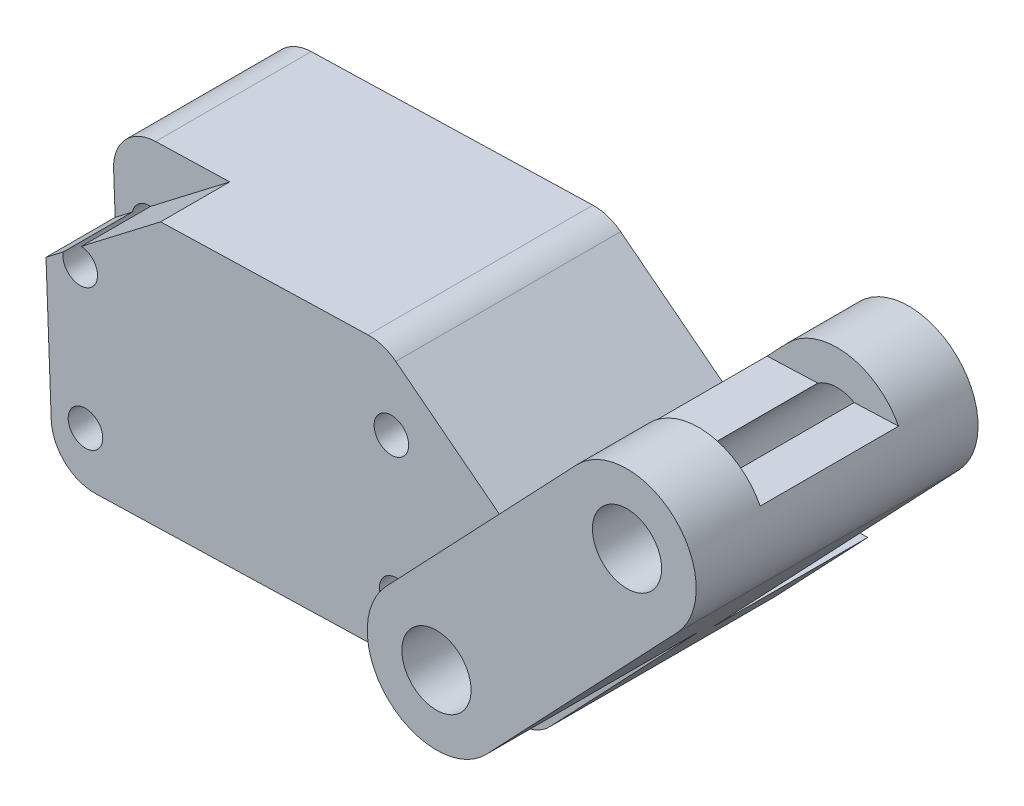
ISO-10303-21;
HEADER;
FILE_DESCRIPTION(('STEP AP214'),'2;1');
FILE_NAME('part.step','',(''),(''),'','','');
FILE_SCHEMA(('AUTOMOTIVE_DESIGN { 1 0 10303 214 1 1 1 1 }'));
ENDSEC;
DATA;
#1=APPLICATION_CONTEXT('core data for automotive mechanical design processes');
#2=APPLICATION_PROTOCOL_DEFINITION('international standard','automotive_design',2000,#1);
#3=PRODUCT_CONTEXT('',#1,'mechanical');
#4=PRODUCT('Part','Part','',(#3));
#5=PRODUCT_RELATED_PRODUCT_CATEGORY('part','',(#4));
#6=PRODUCT_DEFINITION_FORMATION('','',#4);
#7=PRODUCT_DEFINITION_CONTEXT('part definition',#1,'design');
#8=PRODUCT_DEFINITION('design','',#6,#7);
#9=PRODUCT_DEFINITION_SHAPE('','',#8);
#10=(LENGTH_UNIT() NAMED_UNIT(*) SI_UNIT(.MILLI.,.METRE.));
#11=(NAMED_UNIT(*) PLANE_ANGLE_UNIT() SI_UNIT($,.RADIAN.));
#12=(NAMED_UNIT(*) SI_UNIT($,.STERADIAN.) SOLID_ANGLE_UNIT());
#13=UNCERTAINTY_MEASURE_WITH_UNIT(LENGTH_MEASURE(1.E-05),#10,'distance_accuracy_value','');
#14=(GEOMETRIC_REPRESENTATION_CONTEXT(3) GLOBAL_UNCERTAINTY_ASSIGNED_CONTEXT((#13)) GLOBAL_UNIT_ASSIGNED_CONTEXT((#10,
#11,#12)) REPRESENTATION_CONTEXT('',''));
#15=CARTESIAN_POINT('',(0.,0.,0.));
#16=DIRECTION('',(0.,0.,1.));
#17=DIRECTION('',(1.,0.,0.));
#18=AXIS2_PLACEMENT_3D('',#15,#16,#17);
#19=CARTESIAN_POINT('',(37.5160112092171,196.601152002424,9.));
#20=DIRECTION('',(0.,0.,-1.));
#21=DIRECTION('',(-1.,0.,0.));
#22=AXIS2_PLACEMENT_3D('',#19,#20,#21);
#23=PLANE('',#22);
#24=DIRECTION('',(-0.79320452193776,-0.608955323794356,0.));
#25=VECTOR('',#24,1.);
#26=CARTESIAN_POINT('',(-86.5725087238443,112.76640947545,9.));
#27=LINE('',#26,#25);
#28=CARTESIAN_POINT('',(19.8175338907724,194.443683188676,9.));
#29=VERTEX_POINT('',#28);
#30=CARTESIAN_POINT('',(18.8193734631058,193.67738006052,9.));
#31=VERTEX_POINT('',#30);
#32=EDGE_CURVE('E340',#29,#31,#27,.T.);
#33=ORIENTED_EDGE('',*,*,#32,.F.);
#34=CARTESIAN_POINT('',(20.7990479242895,194.252293006042,9.));
#35=DIRECTION('',(0.,0.,1.));
#36=DIRECTION('',(1.,0.,0.));
#37=AXIS2_PLACEMENT_3D('',#34,#35,#36);
#38=CIRCLE('',#37,1.);
#39=CARTESIAN_POINT('',(20.8677260474399,195.249931876275,9.));
#40=VERTEX_POINT('',#39);
#41=EDGE_CURVE('E396',#40,#29,#38,.T.);
#42=ORIENTED_EDGE('',*,*,#41,.F.);
#43=CARTESIAN_POINT('',(25.4461862904481,198.764886295533,9.));
#44=VERTEX_POINT('',#43);
#45=EDGE_CURVE('E336',#44,#40,#27,.T.);
#46=ORIENTED_EDGE('',*,*,#45,.F.);
#47=DIRECTION('',(-0.999609882361627,-0.0279299675075829,0.));
#48=VECTOR('',#47,1.);
#49=CARTESIAN_POINT('',(37.4461862904481,199.100176708328,9.));
#50=LINE('',#49,#48);
#51=CARTESIAN_POINT('',(21.1579131146162,198.645068221925,9.));
#52=VERTEX_POINT('',#51);
#53=EDGE_CURVE('E404',#44,#52,#50,.T.);
#54=ORIENTED_EDGE('',*,*,#53,.T.);
#55=CARTESIAN_POINT('',(21.2277380333852,196.14604351602,9.));
#56=DIRECTION('',(0.,0.,1.));
#57=DIRECTION('',(-1.,0.,0.));
#58=AXIS2_PLACEMENT_3D('',#55,#56,#57);
#59=CIRCLE('',#58,2.50000000000002);
#60=CARTESIAN_POINT('',(18.7295263589668,196.051500246563,9.));
#61=VERTEX_POINT('',#60);
#62=EDGE_CURVE('E407',#52,#61,#59,.T.);
#63=ORIENTED_EDGE('',*,*,#62,.T.);
#64=DIRECTION('',(0.0378173077828495,-0.999284669767358,0.));
#65=VECTOR('',#64,1.);
#66=CARTESIAN_POINT('',(18.7295263589668,196.051500246563,9.));
#67=LINE('',#66,#65);
#68=EDGE_CURVE('E411',#61,#31,#67,.T.);
#69=ORIENTED_EDGE('',*,*,#68,.T.);
#70=EDGE_LOOP('',(#33,#42,#46,#54,#63,#69));
#71=FACE_BOUND('',#70,.T.);
#72=ADVANCED_FACE('F40',(#71),#23,.F.);
#73=CARTESIAN_POINT('',(37.5160112092171,196.601152002424,0.));
#74=DIRECTION('',(0.,0.,-1.));
#75=DIRECTION('',(-1.,0.,0.));
#76=AXIS2_PLACEMENT_3D('',#73,#74,#75);
#77=PLANE('',#76);
#78=CARTESIAN_POINT('',(39.0954595606112,186.760388464443,0.));
#79=DIRECTION('',(0.,0.,1.));
#80=DIRECTION('',(1.,0.,0.));
#81=AXIS2_PLACEMENT_3D('',#78,#79,#80);
#82=CIRCLE('',#81,0.999999999999998);
#83=CARTESIAN_POINT('',(40.0954595606112,186.760388464443,0.));
#84=VERTEX_POINT('',#83);
#85=EDGE_CURVE('E387',#84,#84,#82,.T.);
#86=ORIENTED_EDGE('',*,*,#85,.T.);
#87=EDGE_LOOP('',(#86));
#88=FACE_BOUND('',#87,.T.);
#89=CARTESIAN_POINT('',(20.7990479242895,194.252293006042,0.));
#90=DIRECTION('',(0.,0.,1.));
#91=DIRECTION('',(1.,0.,0.));
#92=AXIS2_PLACEMENT_3D('',#89,#90,#91);
#93=CIRCLE('',#92,1.);
#94=CARTESIAN_POINT('',(21.7990479242895,194.252293006042,0.));
#95=VERTEX_POINT('',#94);
#96=EDGE_CURVE('E395',#95,#95,#93,.T.);
#97=ORIENTED_EDGE('',*,*,#96,.T.);
#98=EDGE_LOOP('',(#97));
#99=FACE_BOUND('',#98,.T.);
#100=CARTESIAN_POINT('',(37.5160112092171,196.601152002424,0.));
#101=DIRECTION('',(0.,0.,1.));
#102=DIRECTION('',(-1.,0.,0.));
#103=AXIS2_PLACEMENT_3D('',#100,#101,#102);
#104=CIRCLE('',#103,2.49999999999999);
#105=CARTESIAN_POINT('',(39.05039403232,198.5748970093,0.));
#106=VERTEX_POINT('',#105);
#107=CARTESIAN_POINT('',(37.4461862904481,199.100176708328,0.));
#108=VERTEX_POINT('',#107);
#109=EDGE_CURVE('E400',#106,#108,#104,.T.);
#110=ORIENTED_EDGE('',*,*,#109,.F.);
#111=DIRECTION('',(-0.789498002750276,0.613753129241168,0.));
#112=VECTOR('',#111,1.);
#113=CARTESIAN_POINT('',(48.8869240844552,190.928011166217,0.));
#114=LINE('',#113,#112);
#115=CARTESIAN_POINT('',(48.8869240844552,190.928011166217,0.));
#116=VERTEX_POINT('',#115);
#117=EDGE_CURVE('E408',#116,#106,#114,.T.);
#118=ORIENTED_EDGE('',*,*,#117,.F.);
#119=CARTESIAN_POINT('',(50.4213069075581,192.901756173093,0.));
#120=DIRECTION('',(0.,0.,-1.));
#121=DIRECTION('',(1.,0.,0.));
#122=AXIS2_PLACEMENT_3D('',#119,#120,#121);
#123=CIRCLE('',#122,2.50000000000002);
#124=CARTESIAN_POINT('',(50.4213069075581,190.401756173093,0.));
#125=VERTEX_POINT('',#124);
#126=EDGE_CURVE('E453',#125,#116,#123,.T.);
#127=ORIENTED_EDGE('',*,*,#126,.F.);
#128=DIRECTION('',(-1.,0.,0.));
#129=VECTOR('',#128,1.);
#130=CARTESIAN_POINT('',(53.3406479353066,190.401756173093,0.));
#131=LINE('',#130,#129);
#132=CARTESIAN_POINT('',(53.3406479353066,190.401756173093,0.));
#133=VERTEX_POINT('',#132);
#134=EDGE_CURVE('E450',#133,#125,#131,.T.);
#135=ORIENTED_EDGE('',*,*,#134,.F.);
#136=DIRECTION('',(0.688857904234529,0.724896397958779,0.));
#137=VECTOR('',#136,1.);
#138=CARTESIAN_POINT('',(47.9555907424031,184.73497273642,0.));
#139=LINE('',#138,#137);
#140=CARTESIAN_POINT('',(47.9555907424031,184.73497273642,0.));
#141=VERTEX_POINT('',#140);
#142=EDGE_CURVE('E447',#141,#133,#139,.T.);
#143=ORIENTED_EDGE('',*,*,#142,.F.);
#144=CARTESIAN_POINT('',(46.1433497475062,186.457117497006,0.));
#145=DIRECTION('',(0.,0.,1.));
#146=DIRECTION('',(-1.,0.,0.));
#147=AXIS2_PLACEMENT_3D('',#144,#145,#146);
#148=CIRCLE('',#147,2.50000000000002);
#149=CARTESIAN_POINT('',(46.2131746662751,183.958092791102,0.));
#150=VERTEX_POINT('',#149);
#151=EDGE_CURVE('E444',#150,#141,#148,.T.);
#152=ORIENTED_EDGE('',*,*,#151,.F.);
#153=DIRECTION('',(0.999609882361627,0.0279299675075837,0.));
#154=VECTOR('',#153,1.);
#155=CARTESIAN_POINT('',(21.6901650883835,183.272898624073,0.));
#156=LINE('',#155,#154);
#157=CARTESIAN_POINT('',(21.6901650883835,183.272898624073,0.));
#158=VERTEX_POINT('',#157);
#159=EDGE_CURVE('E441',#158,#150,#156,.T.);
#160=ORIENTED_EDGE('',*,*,#159,.F.);
#161=CARTESIAN_POINT('',(21.6203401696145,185.771923329977,0.));
#162=DIRECTION('',(0.,0.,1.));
#163=DIRECTION('',(-1.,0.,0.));
#164=AXIS2_PLACEMENT_3D('',#161,#162,#163);
#165=CIRCLE('',#164,2.50000000000002);
#166=CARTESIAN_POINT('',(19.1221284951961,185.67738006052,0.));
#167=VERTEX_POINT('',#166);
#168=EDGE_CURVE('E438',#167,#158,#165,.T.);
#169=ORIENTED_EDGE('',*,*,#168,.F.);
#170=DIRECTION('',(0.0378173077828495,-0.999284669767358,0.));
#171=VECTOR('',#170,1.);
#172=CARTESIAN_POINT('',(18.7295263589668,196.051500246563,0.));
#173=LINE('',#172,#171);
#174=CARTESIAN_POINT('',(18.7295263589668,196.051500246563,0.));
#175=VERTEX_POINT('',#174);
#176=EDGE_CURVE('E435',#175,#167,#173,.T.);
#177=ORIENTED_EDGE('',*,*,#176,.F.);
#178=CARTESIAN_POINT('',(21.2277380333852,196.14604351602,0.));
#179=DIRECTION('',(0.,0.,1.));
#180=DIRECTION('',(-1.,0.,0.));
#181=AXIS2_PLACEMENT_3D('',#178,#179,#180);
#182=CIRCLE('',#181,2.50000000000002);
#183=CARTESIAN_POINT('',(21.1579131146162,198.645068221925,0.));
#184=VERTEX_POINT('',#183);
#185=EDGE_CURVE('E432',#184,#175,#182,.T.);
#186=ORIENTED_EDGE('',*,*,#185,.F.);
#187=DIRECTION('',(-0.999609882361627,-0.0279299675075829,0.));
#188=VECTOR('',#187,1.);
#189=CARTESIAN_POINT('',(37.4461862904481,199.100176708328,0.));
#190=LINE('',#189,#188);
#191=EDGE_CURVE('E429',#108,#184,#190,.T.);
#192=ORIENTED_EDGE('',*,*,#191,.F.);
#193=EDGE_LOOP('',(#110,#118,#127,#135,#143,#152,#160,#169,#177,#186,#192));
#194=FACE_BOUND('',#193,.T.);
#195=CARTESIAN_POINT('',(38.7929062936212,194.755057022744,0.));
#196=DIRECTION('',(0.,0.,1.));
#197=DIRECTION('',(1.,0.,0.));
#198=AXIS2_PLACEMENT_3D('',#195,#196,#197);
#199=CIRCLE('',#198,0.999999999999998);
#200=CARTESIAN_POINT('',(39.7929062936212,194.755057022744,0.));
#201=VERTEX_POINT('',#200);
#202=EDGE_CURVE('E391',#201,#201,#199,.T.);
#203=ORIENTED_EDGE('',*,*,#202,.T.);
#204=EDGE_LOOP('',(#203));
#205=FACE_BOUND('',#204,.T.);
#206=CARTESIAN_POINT('',(21.1016011912795,186.25762444774,0.));
#207=DIRECTION('',(0.,0.,1.));
#208=DIRECTION('',(1.,0.,0.));
#209=AXIS2_PLACEMENT_3D('',#206,#207,#208);
#210=CIRCLE('',#209,1.);
#211=CARTESIAN_POINT('',(22.1016011912795,186.25762444774,0.));
#212=VERTEX_POINT('',#211);
#213=EDGE_CURVE('E383',#212,#212,#210,.T.);
#214=ORIENTED_EDGE('',*,*,#213,.T.);
#215=EDGE_LOOP('',(#214));
#216=FACE_BOUND('',#215,.T.);
#217=ADVANCED_FACE('F611',(#88,#99,#194,#205,#216),#77,.T.);
#218=CARTESIAN_POINT('',(37.5160112092171,196.601152002424,9.));
#219=DIRECTION('',(0.,0.,-1.));
#220=DIRECTION('',(-1.,0.,0.));
#221=AXIS2_PLACEMENT_3D('',#218,#219,#220);
#222=CYLINDRICAL_SURFACE('',#221,2.49999999999999);
#223=ORIENTED_EDGE('',*,*,#109,.T.);
#224=DIRECTION('',(0.,0.,-1.));
#225=VECTOR('',#224,1.);
#226=CARTESIAN_POINT('',(37.4461862904481,199.100176708328,9.));
#227=LINE('',#226,#225);
#228=CARTESIAN_POINT('',(37.4461862904481,199.100176708328,13.));
#229=VERTEX_POINT('',#228);
#230=EDGE_CURVE('E497',#229,#108,#227,.T.);
#231=ORIENTED_EDGE('',*,*,#230,.F.);
#232=CARTESIAN_POINT('',(37.5160112092171,196.601152002424,13.));
#233=DIRECTION('',(0.,0.,1.));
#234=DIRECTION('',(1.,0.,0.));
#235=AXIS2_PLACEMENT_3D('',#232,#233,#234);
#236=CIRCLE('',#235,2.49999999999999);
#237=CARTESIAN_POINT('',(39.05039403232,198.5748970093,13.));
#238=VERTEX_POINT('',#237);
#239=EDGE_CURVE('E287',#238,#229,#236,.T.);
#240=ORIENTED_EDGE('',*,*,#239,.F.);
#241=DIRECTION('',(0.,0.,-1.));
#242=VECTOR('',#241,1.);
#243=CARTESIAN_POINT('',(39.05039403232,198.5748970093,9.));
#244=LINE('',#243,#242);
#245=EDGE_CURVE('E425',#238,#106,#244,.T.);
#246=ORIENTED_EDGE('',*,*,#245,.T.);
#247=EDGE_LOOP('',(#223,#231,#240,#246));
#248=FACE_BOUND('',#247,.T.);
#249=ADVANCED_FACE('F42',(#248),#222,.T.);
#250=CARTESIAN_POINT('',(37.4461862904481,199.100176708328,9.));
#251=DIRECTION('',(0.0279299675075829,-0.999609882361627,0.));
#252=DIRECTION('',(0.999609882361627,0.0279299675075829,0.));
#253=AXIS2_PLACEMENT_3D('',#250,#251,#252);
#254=PLANE('',#253);
#255=ORIENTED_EDGE('',*,*,#191,.T.);
#256=DIRECTION('',(0.,0.,-1.));
#257=VECTOR('',#256,1.);
#258=CARTESIAN_POINT('',(21.1579131146162,198.645068221925,9.));
#259=LINE('',#258,#257);
#260=EDGE_CURVE('E493',#52,#184,#259,.T.);
#261=ORIENTED_EDGE('',*,*,#260,.F.);
#262=ORIENTED_EDGE('',*,*,#53,.F.);
#263=DIRECTION('',(0.,0.,-1.));
#264=VECTOR('',#263,1.);
#265=CARTESIAN_POINT('',(25.4461862904482,198.764886295533,13.));
#266=LINE('',#265,#264);
#267=CARTESIAN_POINT('',(25.4461862904482,198.764886295533,13.));
#268=VERTEX_POINT('',#267);
#269=EDGE_CURVE('E375',#268,#44,#266,.T.);
#270=ORIENTED_EDGE('',*,*,#269,.F.);
#271=DIRECTION('',(-0.999609882361627,-0.0279299675075829,0.));
#272=VECTOR('',#271,1.);
#273=CARTESIAN_POINT('',(-5.5294809395531,197.899399274521,13.));
#274=LINE('',#273,#272);
#275=EDGE_CURVE('E291',#229,#268,#274,.T.);
#276=ORIENTED_EDGE('',*,*,#275,.F.);
#277=ORIENTED_EDGE('',*,*,#230,.T.);
#278=EDGE_LOOP('',(#255,#261,#262,#270,#276,#277));
#279=FACE_BOUND('',#278,.T.);
#280=ADVANCED_FACE('F645',(#279),#254,.F.);
#281=CARTESIAN_POINT('',(21.2277380333852,196.14604351602,9.));
#282=DIRECTION('',(0.,0.,-1.));
#283=DIRECTION('',(-1.,0.,0.));
#284=AXIS2_PLACEMENT_3D('',#281,#282,#283);
#285=CYLINDRICAL_SURFACE('',#284,2.50000000000002);
#286=ORIENTED_EDGE('',*,*,#185,.T.);
#287=DIRECTION('',(0.,0.,-1.));
#288=VECTOR('',#287,1.);
#289=CARTESIAN_POINT('',(18.7295263589668,196.051500246563,9.));
#290=LINE('',#289,#288);
#291=EDGE_CURVE('E489',#61,#175,#290,.T.);
#292=ORIENTED_EDGE('',*,*,#291,.F.);
#293=ORIENTED_EDGE('',*,*,#62,.F.);
#294=ORIENTED_EDGE('',*,*,#260,.T.);
#295=EDGE_LOOP('',(#286,#292,#293,#294));
#296=FACE_BOUND('',#295,.T.);
#297=ADVANCED_FACE('F659',(#296),#285,.T.);
#298=CARTESIAN_POINT('',(18.7295263589668,196.051500246563,9.));
#299=DIRECTION('',(0.999284669767358,0.0378173077828495,0.));
#300=DIRECTION('',(-0.0378173077828495,0.999284669767358,0.));
#301=AXIS2_PLACEMENT_3D('',#298,#299,#300);
#302=PLANE('',#301);
#303=ORIENTED_EDGE('',*,*,#176,.T.);
#304=DIRECTION('',(0.,0.,-1.));
#305=VECTOR('',#304,1.);
#306=CARTESIAN_POINT('',(19.1221284951961,185.67738006052,9.));
#307=LINE('',#306,#305);
#308=CARTESIAN_POINT('',(19.1221284951961,185.67738006052,13.));
#309=VERTEX_POINT('',#308);
#310=EDGE_CURVE('E485',#309,#167,#307,.T.);
#311=ORIENTED_EDGE('',*,*,#310,.F.);
#312=DIRECTION('',(0.0378173077828495,-0.999284669767358,0.));
#313=VECTOR('',#312,1.);
#314=CARTESIAN_POINT('',(26.1115767175959,0.98817640588312,13.));
#315=LINE('',#314,#313);
#316=CARTESIAN_POINT('',(18.8193734631058,193.67738006052,13.));
#317=VERTEX_POINT('',#316);
#318=EDGE_CURVE('E301',#317,#309,#315,.T.);
#319=ORIENTED_EDGE('',*,*,#318,.F.);
#320=DIRECTION('',(0.,0.,-1.));
#321=VECTOR('',#320,1.);
#322=CARTESIAN_POINT('',(18.8193734631058,193.67738006052,13.));
#323=LINE('',#322,#321);
#324=EDGE_CURVE('E363',#317,#31,#323,.T.);
#325=ORIENTED_EDGE('',*,*,#324,.T.);
#326=ORIENTED_EDGE('',*,*,#68,.F.);
#327=ORIENTED_EDGE('',*,*,#291,.T.);
#328=EDGE_LOOP('',(#303,#311,#319,#325,#326,#327));
#329=FACE_BOUND('',#328,.T.);
#330=ADVANCED_FACE('F596',(#329),#302,.F.);
#331=CARTESIAN_POINT('',(21.6203401696145,185.771923329977,9.));
#332=DIRECTION('',(0.,0.,-1.));
#333=DIRECTION('',(-1.,0.,0.));
#334=AXIS2_PLACEMENT_3D('',#331,#332,#333);
#335=CYLINDRICAL_SURFACE('',#334,2.50000000000002);
#336=ORIENTED_EDGE('',*,*,#168,.T.);
#337=DIRECTION('',(0.,0.,-1.));
#338=VECTOR('',#337,1.);
#339=CARTESIAN_POINT('',(21.6901650883835,183.272898624073,9.));
#340=LINE('',#339,#338);
#341=CARTESIAN_POINT('',(21.6901650883835,183.272898624073,13.));
#342=VERTEX_POINT('',#341);
#343=EDGE_CURVE('E481',#342,#158,#340,.T.);
#344=ORIENTED_EDGE('',*,*,#343,.F.);
#345=CARTESIAN_POINT('',(21.6203401696145,185.771923329977,13.));
#346=DIRECTION('',(0.,0.,1.));
#347=DIRECTION('',(1.,0.,0.));
#348=AXIS2_PLACEMENT_3D('',#345,#346,#347);
#349=CIRCLE('',#348,2.50000000000002);
#350=EDGE_CURVE('E305',#309,#342,#349,.T.);
#351=ORIENTED_EDGE('',*,*,#350,.F.);
#352=ORIENTED_EDGE('',*,*,#310,.T.);
#353=EDGE_LOOP('',(#336,#344,#351,#352));
#354=FACE_BOUND('',#353,.T.);
#355=ADVANCED_FACE('F603',(#354),#335,.T.);
#356=CARTESIAN_POINT('',(21.6901650883835,183.272898624073,9.));
#357=DIRECTION('',(-0.0279299675075837,0.999609882361627,0.));
#358=DIRECTION('',(-0.999609882361627,-0.0279299675075837,0.));
#359=AXIS2_PLACEMENT_3D('',#356,#357,#358);
#360=PLANE('',#359);
#361=ORIENTED_EDGE('',*,*,#159,.T.);
#362=DIRECTION('',(0.,0.,-1.));
#363=VECTOR('',#362,1.);
#364=CARTESIAN_POINT('',(46.2131746662751,183.958092791102,9.));
#365=LINE('',#364,#363);
#366=CARTESIAN_POINT('',(46.2131746662751,183.958092791102,13.));
#367=VERTEX_POINT('',#366);
#368=EDGE_CURVE('E477',#367,#150,#365,.T.);
#369=ORIENTED_EDGE('',*,*,#368,.F.);
#370=DIRECTION('',(0.999609882361627,0.0279299675075837,0.));
#371=VECTOR('',#370,1.);
#372=CARTESIAN_POINT('',(-5.09988903614687,182.524361265222,13.));
#373=LINE('',#372,#371);
#374=EDGE_CURVE('E309',#342,#367,#373,.T.);
#375=ORIENTED_EDGE('',*,*,#374,.F.);
#376=ORIENTED_EDGE('',*,*,#343,.T.);
#377=EDGE_LOOP('',(#361,#369,#375,#376));
#378=FACE_BOUND('',#377,.T.);
#379=ADVANCED_FACE('F607',(#378),#360,.F.);
#380=CARTESIAN_POINT('',(46.1433497475062,186.457117497006,9.));
#381=DIRECTION('',(0.,0.,-1.));
#382=DIRECTION('',(-1.,0.,0.));
#383=AXIS2_PLACEMENT_3D('',#380,#381,#382);
#384=CYLINDRICAL_SURFACE('',#383,2.50000000000002);
#385=ORIENTED_EDGE('',*,*,#151,.T.);
#386=DIRECTION('',(0.,0.,-1.));
#387=VECTOR('',#386,1.);
#388=CARTESIAN_POINT('',(47.9555907424031,184.73497273642,9.));
#389=LINE('',#388,#387);
#390=CARTESIAN_POINT('',(47.9555907424031,184.73497273642,13.));
#391=VERTEX_POINT('',#390);
#392=EDGE_CURVE('E473',#391,#141,#389,.T.);
#393=ORIENTED_EDGE('',*,*,#392,.F.);
#394=CARTESIAN_POINT('',(46.1433497475062,186.457117497006,13.));
#395=DIRECTION('',(0.,0.,1.));
#396=DIRECTION('',(1.,0.,0.));
#397=AXIS2_PLACEMENT_3D('',#394,#395,#396);
#398=CIRCLE('',#397,2.50000000000002);
#399=EDGE_CURVE('E313',#367,#391,#398,.T.);
#400=ORIENTED_EDGE('',*,*,#399,.F.);
#401=ORIENTED_EDGE('',*,*,#368,.T.);
#402=EDGE_LOOP('',(#385,#393,#400,#401));
#403=FACE_BOUND('',#402,.T.);
#404=ADVANCED_FACE('F617',(#403),#384,.T.);
#405=CARTESIAN_POINT('',(47.9555907424031,184.73497273642,9.));
#406=DIRECTION('',(-0.724896397958779,0.688857904234529,0.));
#407=DIRECTION('',(-0.688857904234529,-0.724896397958779,0.));
#408=AXIS2_PLACEMENT_3D('',#405,#406,#407);
#409=PLANE('',#408);
#410=ORIENTED_EDGE('',*,*,#142,.T.);
#411=DIRECTION('',(0.,0.,-1.));
#412=VECTOR('',#411,1.);
#413=CARTESIAN_POINT('',(53.3406479353066,190.401756173093,9.));
#414=LINE('',#413,#412);
#415=CARTESIAN_POINT('',(53.3406479353066,190.401756173093,9.));
#416=VERTEX_POINT('',#415);
#417=EDGE_CURVE('E469',#416,#133,#414,.T.);
#418=ORIENTED_EDGE('',*,*,#417,.F.);
#419=DIRECTION('',(0.688857904234545,0.724896397958764,0.));
#420=VECTOR('',#419,1.);
#421=CARTESIAN_POINT('',(-67.0480681001528,63.7147484861329,9.));
#422=LINE('',#421,#420);
#423=CARTESIAN_POINT('',(67.6196723965515,205.427806298515,9.));
#424=VERTEX_POINT('',#423);
#425=EDGE_CURVE('E341',#416,#424,#422,.T.);
#426=ORIENTED_EDGE('',*,*,#425,.T.);
#427=DIRECTION('',(0.,0.,-1.));
#428=VECTOR('',#427,1.);
#429=CARTESIAN_POINT('',(67.6196723965515,205.427806298515,13.));
#430=LINE('',#429,#428);
#431=CARTESIAN_POINT('',(67.6196723965515,205.427806298515,25.3));
#432=VERTEX_POINT('',#431);
#433=EDGE_CURVE('E359',#432,#424,#430,.T.);
#434=ORIENTED_EDGE('',*,*,#433,.F.);
#435=DIRECTION('',(0.688857904234546,0.724896397958763,0.));
#436=VECTOR('',#435,1.);
#437=CARTESIAN_POINT('',(67.6196723965515,205.427806298515,25.3));
#438=LINE('',#437,#436);
#439=CARTESIAN_POINT('',(56.5979459287988,193.829463931175,25.3));
#440=VERTEX_POINT('',#439);
#441=EDGE_CURVE('E263',#440,#432,#438,.T.);
#442=ORIENTED_EDGE('',*,*,#441,.F.);
#443=DIRECTION('',(0.,0.,-1.));
#444=VECTOR('',#443,1.);
#445=CARTESIAN_POINT('',(56.5979459287988,193.829463931175,25.3));
#446=LINE('',#445,#444);
#447=CARTESIAN_POINT('',(56.5979459287988,193.829463931175,13.));
#448=VERTEX_POINT('',#447);
#449=EDGE_CURVE('E267',#440,#448,#446,.T.);
#450=ORIENTED_EDGE('',*,*,#449,.T.);
#451=DIRECTION('',(0.688857904234545,0.724896397958764,0.));
#452=VECTOR('',#451,1.);
#453=CARTESIAN_POINT('',(-67.0480681001528,63.7147484861329,13.));
#454=LINE('',#453,#452);
#455=EDGE_CURVE('E317',#391,#448,#454,.T.);
#456=ORIENTED_EDGE('',*,*,#455,.F.);
#457=ORIENTED_EDGE('',*,*,#392,.T.);
#458=EDGE_LOOP('',(#410,#418,#426,#434,#442,#450,#456,#457));
#459=FACE_BOUND('',#458,.T.);
#460=ADVANCED_FACE('F621',(#459),#409,.F.);
#461=CARTESIAN_POINT('',(53.3406479353066,190.401756173093,9.));
#462=DIRECTION('',(0.,-1.,0.));
#463=DIRECTION('',(1.,0.,0.));
#464=AXIS2_PLACEMENT_3D('',#461,#462,#463);
#465=PLANE('',#464);
#466=ORIENTED_EDGE('',*,*,#134,.T.);
#467=DIRECTION('',(0.,0.,-1.));
#468=VECTOR('',#467,1.);
#469=CARTESIAN_POINT('',(50.4213069075581,190.401756173093,9.));
#470=LINE('',#469,#468);
#471=CARTESIAN_POINT('',(50.4213069075581,190.401756173093,9.));
#472=VERTEX_POINT('',#471);
#473=EDGE_CURVE('E465',#472,#125,#470,.T.);
#474=ORIENTED_EDGE('',*,*,#473,.F.);
#475=DIRECTION('',(-1.,0.,0.));
#476=VECTOR('',#475,1.);
#477=CARTESIAN_POINT('',(53.3406479353066,190.401756173093,9.));
#478=LINE('',#477,#476);
#479=EDGE_CURVE('E414',#416,#472,#478,.T.);
#480=ORIENTED_EDGE('',*,*,#479,.F.);
#481=ORIENTED_EDGE('',*,*,#417,.T.);
#482=EDGE_LOOP('',(#466,#474,#480,#481));
#483=FACE_BOUND('',#482,.T.);
#484=ADVANCED_FACE('F682',(#483),#465,.F.);
#485=CARTESIAN_POINT('',(50.4213069075581,192.901756173093,9.));
#486=DIRECTION('',(0.,0.,-1.));
#487=DIRECTION('',(-1.,0.,0.));
#488=AXIS2_PLACEMENT_3D('',#485,#486,#487);
#489=CYLINDRICAL_SURFACE('',#488,2.50000000000002);
#490=ORIENTED_EDGE('',*,*,#126,.T.);
#491=DIRECTION('',(0.,0.,-1.));
#492=VECTOR('',#491,1.);
#493=CARTESIAN_POINT('',(48.8869240844552,190.928011166217,9.));
#494=LINE('',#493,#492);
#495=CARTESIAN_POINT('',(48.8869240844552,190.928011166217,9.));
#496=VERTEX_POINT('',#495);
#497=EDGE_CURVE('E461',#496,#116,#494,.T.);
#498=ORIENTED_EDGE('',*,*,#497,.F.);
#499=CARTESIAN_POINT('',(50.4213069075581,192.901756173093,9.));
#500=DIRECTION('',(0.,0.,-1.));
#501=DIRECTION('',(1.,0.,0.));
#502=AXIS2_PLACEMENT_3D('',#499,#500,#501);
#503=CIRCLE('',#502,2.50000000000002);
#504=EDGE_CURVE('E418',#472,#496,#503,.T.);
#505=ORIENTED_EDGE('',*,*,#504,.F.);
#506=ORIENTED_EDGE('',*,*,#473,.T.);
#507=EDGE_LOOP('',(#490,#498,#505,#506));
#508=FACE_BOUND('',#507,.T.);
#509=ADVANCED_FACE('F679',(#508),#489,.F.);
#510=CARTESIAN_POINT('',(48.8869240844552,190.928011166217,9.));
#511=DIRECTION('',(-0.613753129241168,-0.789498002750276,0.));
#512=DIRECTION('',(0.789498002750276,-0.613753129241168,0.));
#513=AXIS2_PLACEMENT_3D('',#510,#511,#512);
#514=PLANE('',#513);
#515=ORIENTED_EDGE('',*,*,#117,.T.);
#516=ORIENTED_EDGE('',*,*,#245,.F.);
#517=DIRECTION('',(-0.789498002750276,0.613753129241168,0.));
#518=VECTOR('',#517,1.);
#519=CARTESIAN_POINT('',(110.930836816169,142.695279155748,13.));
#520=LINE('',#519,#518);
#521=CARTESIAN_POINT('',(45.3888648446126,193.647390819168,13.));
#522=VERTEX_POINT('',#521);
#523=EDGE_CURVE('E282',#522,#238,#520,.T.);
#524=ORIENTED_EDGE('',*,*,#523,.F.);
#525=DIRECTION('',(0.,0.,-1.));
#526=VECTOR('',#525,1.);
#527=CARTESIAN_POINT('',(45.3888648446126,193.647390819168,13.));
#528=LINE('',#527,#526);
#529=CARTESIAN_POINT('',(45.3888648446126,193.647390819168,9.));
#530=VERTEX_POINT('',#529);
#531=EDGE_CURVE('E379',#522,#530,#528,.T.);
#532=ORIENTED_EDGE('',*,*,#531,.T.);
#533=DIRECTION('',(-0.789498002750276,0.613753129241168,0.));
#534=VECTOR('',#533,1.);
#535=CARTESIAN_POINT('',(48.8869240844552,190.928011166217,9.));
#536=LINE('',#535,#534);
#537=EDGE_CURVE('E422',#496,#530,#536,.T.);
#538=ORIENTED_EDGE('',*,*,#537,.F.);
#539=ORIENTED_EDGE('',*,*,#497,.T.);
#540=EDGE_LOOP('',(#515,#516,#524,#532,#538,#539));
#541=FACE_BOUND('',#540,.T.);
#542=ADVANCED_FACE('F636',(#541),#514,.F.);
#543=CARTESIAN_POINT('',(20.7990479242895,194.252293006042,9.));
#544=DIRECTION('',(0.,0.,-1.));
#545=DIRECTION('',(-1.,0.,0.));
#546=AXIS2_PLACEMENT_3D('',#543,#544,#545);
#547=CYLINDRICAL_SURFACE('',#546,1.);
#548=ORIENTED_EDGE('',*,*,#41,.T.);
#549=DIRECTION('',(0.,0.,-1.));
#550=VECTOR('',#549,1.);
#551=CARTESIAN_POINT('',(19.8175338907724,194.443683188676,13.));
#552=LINE('',#551,#550);
#553=CARTESIAN_POINT('',(19.8175338907724,194.443683188676,13.));
#554=VERTEX_POINT('',#553);
#555=EDGE_CURVE('E367',#554,#29,#552,.T.);
#556=ORIENTED_EDGE('',*,*,#555,.F.);
#557=CARTESIAN_POINT('',(20.7990479242895,194.252293006042,13.));
#558=DIRECTION('',(0.,0.,1.));
#559=DIRECTION('',(1.,0.,0.));
#560=AXIS2_PLACEMENT_3D('',#557,#558,#559);
#561=CIRCLE('',#560,1.);
#562=CARTESIAN_POINT('',(20.8677260474399,195.249931876275,13.));
#563=VERTEX_POINT('',#562);
#564=EDGE_CURVE('E297',#563,#554,#561,.F.);
#565=ORIENTED_EDGE('',*,*,#564,.F.);
#566=DIRECTION('',(0.,0.,-1.));
#567=VECTOR('',#566,1.);
#568=CARTESIAN_POINT('',(20.8677260474399,195.249931876275,13.));
#569=LINE('',#568,#567);
#570=EDGE_CURVE('E371',#563,#40,#569,.T.);
#571=ORIENTED_EDGE('',*,*,#570,.T.);
#572=EDGE_LOOP('',(#548,#556,#565,#571));
#573=FACE_BOUND('',#572,.T.);
#574=ORIENTED_EDGE('',*,*,#96,.F.);
#575=EDGE_LOOP('',(#574));
#576=FACE_BOUND('',#575,.T.);
#577=ADVANCED_FACE('F654',(#573,#576),#547,.F.);
#578=CARTESIAN_POINT('',(38.7929062936212,194.755057022744,9.));
#579=DIRECTION('',(0.,0.,-1.));
#580=DIRECTION('',(-1.,0.,0.));
#581=AXIS2_PLACEMENT_3D('',#578,#579,#580);
#582=CYLINDRICAL_SURFACE('',#581,0.999999999999998);
#583=ORIENTED_EDGE('',*,*,#202,.F.);
#584=EDGE_LOOP('',(#583));
#585=FACE_BOUND('',#584,.T.);
#586=CARTESIAN_POINT('',(38.7929062936212,194.755057022744,13.));
#587=DIRECTION('',(0.,0.,1.));
#588=DIRECTION('',(1.,0.,0.));
#589=AXIS2_PLACEMENT_3D('',#586,#587,#588);
#590=CIRCLE('',#589,0.999999999999998);
#591=CARTESIAN_POINT('',(39.7929062936212,194.755057022744,13.));
#592=VERTEX_POINT('',#591);
#593=EDGE_CURVE('E328',#592,#592,#590,.F.);
#594=ORIENTED_EDGE('',*,*,#593,.F.);
#595=EDGE_LOOP('',(#594));
#596=FACE_BOUND('',#595,.T.);
#597=ADVANCED_FACE('F728',(#585,#596),#582,.F.);
#598=CARTESIAN_POINT('',(39.0954595606112,186.760388464443,9.));
#599=DIRECTION('',(0.,0.,-1.));
#600=DIRECTION('',(-1.,0.,0.));
#601=AXIS2_PLACEMENT_3D('',#598,#599,#600);
#602=CYLINDRICAL_SURFACE('',#601,0.999999999999998);
#603=ORIENTED_EDGE('',*,*,#85,.F.);
#604=EDGE_LOOP('',(#603));
#605=FACE_BOUND('',#604,.T.);
#606=CARTESIAN_POINT('',(39.0954595606112,186.760388464443,13.));
#607=DIRECTION('',(0.,0.,1.));
#608=DIRECTION('',(1.,0.,0.));
#609=AXIS2_PLACEMENT_3D('',#606,#607,#608);
#610=CIRCLE('',#609,0.999999999999998);
#611=CARTESIAN_POINT('',(40.0954595606112,186.760388464443,13.));
#612=VERTEX_POINT('',#611);
#613=EDGE_CURVE('E320',#612,#612,#610,.F.);
#614=ORIENTED_EDGE('',*,*,#613,.F.);
#615=EDGE_LOOP('',(#614));
#616=FACE_BOUND('',#615,.T.);
#617=ADVANCED_FACE('F734',(#605,#616),#602,.F.);
#618=CARTESIAN_POINT('',(21.1016011912795,186.25762444774,9.));
#619=DIRECTION('',(0.,0.,-1.));
#620=DIRECTION('',(-1.,0.,0.));
#621=AXIS2_PLACEMENT_3D('',#618,#619,#620);
#622=CYLINDRICAL_SURFACE('',#621,1.);
#623=ORIENTED_EDGE('',*,*,#213,.F.);
#624=EDGE_LOOP('',(#623));
#625=FACE_BOUND('',#624,.T.);
#626=CARTESIAN_POINT('',(21.1016011912795,186.25762444774,13.));
#627=DIRECTION('',(0.,0.,1.));
#628=DIRECTION('',(1.,0.,0.));
#629=AXIS2_PLACEMENT_3D('',#626,#627,#628);
#630=CIRCLE('',#629,1.);
#631=CARTESIAN_POINT('',(22.1016011912795,186.25762444774,13.));
#632=VERTEX_POINT('',#631);
#633=EDGE_CURVE('E324',#632,#632,#630,.F.);
#634=ORIENTED_EDGE('',*,*,#633,.F.);
#635=EDGE_LOOP('',(#634));
#636=FACE_BOUND('',#635,.T.);
#637=ADVANCED_FACE('F741',(#625,#636),#622,.F.);
#638=CARTESIAN_POINT('',(0.,0.,9.));
#639=DIRECTION('',(0.,0.,1.));
#640=DIRECTION('',(1.,0.,0.));
#641=AXIS2_PLACEMENT_3D('',#638,#639,#640);
#642=PLANE('',#641);
#643=CARTESIAN_POINT('',(64.7200868047165,208.183237915453,9.));
#644=DIRECTION('',(0.,0.,1.));
#645=DIRECTION('',(1.,0.,0.));
#646=AXIS2_PLACEMENT_3D('',#643,#644,#645);
#647=CIRCLE('',#646,2.);
#648=CARTESIAN_POINT('',(66.7200868047165,208.183237915453,9.));
#649=VERTEX_POINT('',#648);
#650=EDGE_CURVE('E283',#649,#649,#647,.T.);
#651=ORIENTED_EDGE('',*,*,#650,.T.);
#652=EDGE_LOOP('',(#651));
#653=FACE_BOUND('',#652,.T.);
#654=CARTESIAN_POINT('',(53.6983603369638,196.584895548113,9.));
#655=DIRECTION('',(0.,0.,1.));
#656=DIRECTION('',(1.,0.,0.));
#657=AXIS2_PLACEMENT_3D('',#654,#655,#656);
#658=CIRCLE('',#657,2.);
#659=CARTESIAN_POINT('',(55.6983603369638,196.584895548113,9.));
#660=VERTEX_POINT('',#659);
#661=EDGE_CURVE('E348',#660,#660,#658,.T.);
#662=ORIENTED_EDGE('',*,*,#661,.T.);
#663=EDGE_LOOP('',(#662));
#664=FACE_BOUND('',#663,.T.);
#665=ORIENTED_EDGE('',*,*,#425,.F.);
#666=ORIENTED_EDGE('',*,*,#479,.T.);
#667=ORIENTED_EDGE('',*,*,#504,.T.);
#668=ORIENTED_EDGE('',*,*,#537,.T.);
#669=DIRECTION('',(-0.688857904234546,-0.724896397958763,0.));
#670=VECTOR('',#669,1.);
#671=CARTESIAN_POINT('',(-72.847239283823,69.2256117200095,9.));
#672=LINE('',#671,#670);
#673=CARTESIAN_POINT('',(61.8205012128814,210.938669532391,9.));
#674=VERTEX_POINT('',#673);
#675=EDGE_CURVE('E278',#674,#530,#672,.T.);
#676=ORIENTED_EDGE('',*,*,#675,.F.);
#677=CARTESIAN_POINT('',(64.7200868047165,208.183237915453,9.));
#678=DIRECTION('',(0.,0.,1.));
#679=DIRECTION('',(1.,0.,0.));
#680=AXIS2_PLACEMENT_3D('',#677,#678,#679);
#681=CIRCLE('',#680,3.99999999999998);
#682=EDGE_CURVE('E344',#674,#424,#681,.F.);
#683=ORIENTED_EDGE('',*,*,#682,.T.);
#684=EDGE_LOOP('',(#665,#666,#667,#668,#676,#683));
#685=FACE_BOUND('',#684,.T.);
#686=ADVANCED_FACE('F749',(#653,#664,#685),#642,.F.);
#687=CARTESIAN_POINT('',(-72.847239283823,69.2256117200095,13.));
#688=DIRECTION('',(0.724896397958763,-0.688857904234546,0.));
#689=DIRECTION('',(0.688857904234546,0.724896397958763,0.));
#690=AXIS2_PLACEMENT_3D('',#687,#688,#689);
#691=PLANE('',#690);
#692=DIRECTION('',(0.,0.,-1.));
#693=VECTOR('',#692,1.);
#694=CARTESIAN_POINT('',(61.8205012128814,210.938669532391,13.));
#695=LINE('',#694,#693);
#696=CARTESIAN_POINT('',(61.8205012128814,210.938669532391,25.3));
#697=VERTEX_POINT('',#696);
#698=CARTESIAN_POINT('',(61.8205012128814,210.938669532391,21.15));
#699=VERTEX_POINT('',#698);
#700=EDGE_CURVE('E355',#697,#699,#695,.T.);
#701=ORIENTED_EDGE('',*,*,#700,.T.);
#702=DIRECTION('',(-0.688857904234546,-0.724896397958763,0.));
#703=VECTOR('',#702,1.);
#704=CARTESIAN_POINT('',(-72.847239283823,69.2256117200095,21.15));
#705=LINE('',#704,#703);
#706=CARTESIAN_POINT('',(60.6731577703,209.731301331147,21.15));
#707=VERTEX_POINT('',#706);
#708=EDGE_CURVE('E238',#699,#707,#705,.T.);
#709=ORIENTED_EDGE('',*,*,#708,.T.);
#710=DIRECTION('',(0.,0.,-1.));
#711=VECTOR('',#710,1.);
#712=CARTESIAN_POINT('',(60.6731577703,209.731301331147,13.));
#713=LINE('',#712,#711);
#714=CARTESIAN_POINT('',(60.6731577703002,209.731301331147,13.15));
#715=VERTEX_POINT('',#714);
#716=EDGE_CURVE('E231',#707,#715,#713,.T.);
#717=ORIENTED_EDGE('',*,*,#716,.T.);
#718=DIRECTION('',(0.688857904234546,0.724896397958763,0.));
#719=VECTOR('',#718,1.);
#720=CARTESIAN_POINT('',(-72.847239283823,69.2256117200095,13.1500000000001));
#721=LINE('',#720,#719);
#722=CARTESIAN_POINT('',(61.8205012128814,210.938669532391,13.15));
#723=VERTEX_POINT('',#722);
#724=EDGE_CURVE('E211',#715,#723,#721,.T.);
#725=ORIENTED_EDGE('',*,*,#724,.T.);
#726=EDGE_CURVE('E332',#723,#674,#695,.T.);
#727=ORIENTED_EDGE('',*,*,#726,.T.);
#728=ORIENTED_EDGE('',*,*,#675,.T.);
#729=ORIENTED_EDGE('',*,*,#531,.F.);
#730=DIRECTION('',(-0.688857904234546,-0.724896397958763,0.));
#731=VECTOR('',#730,1.);
#732=CARTESIAN_POINT('',(-72.847239283823,69.2256117200095,13.));
#733=LINE('',#732,#731);
#734=CARTESIAN_POINT('',(50.7987747451287,199.340327165051,13.));
#735=VERTEX_POINT('',#734);
#736=EDGE_CURVE('E279',#735,#522,#733,.T.);
#737=ORIENTED_EDGE('',*,*,#736,.F.);
#738=DIRECTION('',(0.,0.,-1.));
#739=VECTOR('',#738,1.);
#740=CARTESIAN_POINT('',(50.7987747451288,199.340327165051,25.3));
#741=LINE('',#740,#739);
#742=CARTESIAN_POINT('',(50.7987747451288,199.340327165051,25.3));
#743=VERTEX_POINT('',#742);
#744=EDGE_CURVE('E274',#743,#735,#741,.T.);
#745=ORIENTED_EDGE('',*,*,#744,.F.);
#746=DIRECTION('',(-0.688857904234543,-0.724896397958766,0.));
#747=VECTOR('',#746,1.);
#748=CARTESIAN_POINT('',(61.8205012128814,210.938669532391,25.3));
#749=LINE('',#748,#747);
#750=EDGE_CURVE('E257',#697,#743,#749,.T.);
#751=ORIENTED_EDGE('',*,*,#750,.F.);
#752=EDGE_LOOP('',(#701,#709,#717,#725,#727,#728,#729,#737,#745,#751));
#753=FACE_BOUND('',#752,.T.);
#754=ADVANCED_FACE('F631',(#753),#691,.F.);
#755=CARTESIAN_POINT('',(-86.5725087238443,112.76640947545,13.));
#756=DIRECTION('',(0.608955323794356,-0.79320452193776,0.));
#757=DIRECTION('',(0.79320452193776,0.608955323794356,0.));
#758=AXIS2_PLACEMENT_3D('',#755,#756,#757);
#759=PLANE('',#758);
#760=ORIENTED_EDGE('',*,*,#45,.T.);
#761=ORIENTED_EDGE('',*,*,#570,.F.);
#762=DIRECTION('',(-0.79320452193776,-0.608955323794356,0.));
#763=VECTOR('',#762,1.);
#764=CARTESIAN_POINT('',(-86.5725087238443,112.76640947545,13.));
#765=LINE('',#764,#763);
#766=EDGE_CURVE('E294',#268,#563,#765,.T.);
#767=ORIENTED_EDGE('',*,*,#766,.F.);
#768=ORIENTED_EDGE('',*,*,#269,.T.);
#769=EDGE_LOOP('',(#760,#761,#767,#768));
#770=FACE_BOUND('',#769,.T.);
#771=ADVANCED_FACE('F651',(#770),#759,.F.);
#772=ORIENTED_EDGE('',*,*,#32,.T.);
#773=ORIENTED_EDGE('',*,*,#324,.F.);
#774=EDGE_CURVE('E298',#554,#317,#765,.T.);
#775=ORIENTED_EDGE('',*,*,#774,.F.);
#776=ORIENTED_EDGE('',*,*,#555,.T.);
#777=EDGE_LOOP('',(#772,#773,#775,#776));
#778=FACE_BOUND('',#777,.T.);
#779=ADVANCED_FACE('F589',(#778),#759,.F.);
#780=CARTESIAN_POINT('',(64.7200868047165,208.183237915453,13.));
#781=DIRECTION('',(0.,0.,-1.));
#782=DIRECTION('',(-1.,0.,0.));
#783=AXIS2_PLACEMENT_3D('',#780,#781,#782);
#784=CYLINDRICAL_SURFACE('',#783,2.);
#785=CARTESIAN_POINT('',(64.7200868047165,208.183237915453,21.15));
#786=DIRECTION('',(0.,0.,1.));
#787=DIRECTION('',(1.,0.,0.));
#788=AXIS2_PLACEMENT_3D('',#785,#786,#787);
#789=CIRCLE('',#788,2.);
#790=CARTESIAN_POINT('',(65.7086091096058,209.921864860124,21.15));
#791=VERTEX_POINT('',#790);
#792=CARTESIAN_POINT('',(63.6029856533654,209.842178847991,21.15));
#793=VERTEX_POINT('',#792);
#794=EDGE_CURVE('E225',#791,#793,#789,.T.);
#795=ORIENTED_EDGE('',*,*,#794,.F.);
#796=DIRECTION('',(0.,0.,-1.));
#797=VECTOR('',#796,1.);
#798=CARTESIAN_POINT('',(65.7086091096058,209.921864860124,13.));
#799=LINE('',#798,#797);
#800=CARTESIAN_POINT('',(65.7086091096058,209.921864860124,13.15));
#801=VERTEX_POINT('',#800);
#802=EDGE_CURVE('E210',#801,#791,#799,.F.);
#803=ORIENTED_EDGE('',*,*,#802,.F.);
#804=CARTESIAN_POINT('',(64.7200868047165,208.183237915453,13.15));
#805=DIRECTION('',(0.,0.,-1.));
#806=DIRECTION('',(0.,1.,0.));
#807=AXIS2_PLACEMENT_3D('',#804,#805,#806);
#808=CIRCLE('',#807,2.);
#809=CARTESIAN_POINT('',(63.6029856533654,209.842178847991,13.15));
#810=VERTEX_POINT('',#809);
#811=EDGE_CURVE('E204',#810,#801,#808,.T.);
#812=ORIENTED_EDGE('',*,*,#811,.F.);
#813=DIRECTION('',(0.,0.,-1.));
#814=VECTOR('',#813,1.);
#815=CARTESIAN_POINT('',(63.6029856533654,209.842178847991,13.));
#816=LINE('',#815,#814);
#817=EDGE_CURVE('E227',#793,#810,#816,.T.);
#818=ORIENTED_EDGE('',*,*,#817,.F.);
#819=EDGE_LOOP('',(#795,#803,#812,#818));
#820=FACE_BOUND('',#819,.T.);
#821=ORIENTED_EDGE('',*,*,#650,.F.);
#822=EDGE_LOOP('',(#821));
#823=FACE_BOUND('',#822,.T.);
#824=CARTESIAN_POINT('',(64.7200868047165,208.183237915453,25.3));
#825=DIRECTION('',(0.,0.,1.));
#826=DIRECTION('',(1.,0.,0.));
#827=AXIS2_PLACEMENT_3D('',#824,#825,#826);
#828=CIRCLE('',#827,2.00000000000001);
#829=CARTESIAN_POINT('',(66.7200868047165,208.183237915453,25.3));
#830=VERTEX_POINT('',#829);
#831=EDGE_CURVE('E248',#830,#830,#828,.T.);
#832=ORIENTED_EDGE('',*,*,#831,.T.);
#833=EDGE_LOOP('',(#832));
#834=FACE_BOUND('',#833,.T.);
#835=ADVANCED_FACE('F223',(#820,#823,#834),#784,.F.);
#836=CARTESIAN_POINT('',(53.6983603369638,196.584895548113,13.));
#837=DIRECTION('',(0.,0.,-1.));
#838=DIRECTION('',(-1.,0.,0.));
#839=AXIS2_PLACEMENT_3D('',#836,#837,#838);
#840=CYLINDRICAL_SURFACE('',#839,2.);
#841=ORIENTED_EDGE('',*,*,#661,.F.);
#842=EDGE_LOOP('',(#841));
#843=FACE_BOUND('',#842,.T.);
#844=CARTESIAN_POINT('',(53.6983603369638,196.584895548113,25.3));
#845=DIRECTION('',(0.,0.,1.));
#846=DIRECTION('',(1.,0.,0.));
#847=AXIS2_PLACEMENT_3D('',#844,#845,#846);
#848=CIRCLE('',#847,2.00000000000001);
#849=CARTESIAN_POINT('',(55.6983603369638,196.584895548113,25.3));
#850=VERTEX_POINT('',#849);
#851=EDGE_CURVE('E244',#850,#850,#848,.T.);
#852=ORIENTED_EDGE('',*,*,#851,.T.);
#853=EDGE_LOOP('',(#852));
#854=FACE_BOUND('',#853,.T.);
#855=ADVANCED_FACE('F781',(#843,#854),#840,.F.);
#856=CARTESIAN_POINT('',(64.7200868047165,208.183237915453,13.));
#857=DIRECTION('',(0.,0.,-1.));
#858=DIRECTION('',(-1.,0.,0.));
#859=AXIS2_PLACEMENT_3D('',#856,#857,#858);
#860=CYLINDRICAL_SURFACE('',#859,3.99999999999998);
#861=CARTESIAN_POINT('',(64.7200868047165,208.183237915453,21.15));
#862=DIRECTION('',(0.,0.,1.));
#863=DIRECTION('',(1.,0.,0.));
#864=AXIS2_PLACEMENT_3D('',#861,#862,#863);
#865=CIRCLE('',#864,3.99999999999998);
#866=CARTESIAN_POINT('',(68.2739807308547,210.018949756064,21.15));
#867=VERTEX_POINT('',#866);
#868=EDGE_CURVE('E11',#699,#867,#865,.F.);
#869=ORIENTED_EDGE('',*,*,#868,.F.);
#870=ORIENTED_EDGE('',*,*,#700,.F.);
#871=CARTESIAN_POINT('',(64.7200868047165,208.183237915453,25.3));
#872=DIRECTION('',(0.,0.,1.));
#873=DIRECTION('',(1.,0.,0.));
#874=AXIS2_PLACEMENT_3D('',#871,#872,#873);
#875=CIRCLE('',#874,3.99999999999996);
#876=EDGE_CURVE('E253',#432,#697,#875,.T.);
#877=ORIENTED_EDGE('',*,*,#876,.F.);
#878=ORIENTED_EDGE('',*,*,#433,.T.);
#879=ORIENTED_EDGE('',*,*,#682,.F.);
#880=ORIENTED_EDGE('',*,*,#726,.F.);
#881=CARTESIAN_POINT('',(64.7200868047165,208.183237915453,13.15));
#882=DIRECTION('',(0.,0.,-1.));
#883=DIRECTION('',(0.,1.,0.));
#884=AXIS2_PLACEMENT_3D('',#881,#882,#883);
#885=CIRCLE('',#884,3.99999999999998);
#886=CARTESIAN_POINT('',(68.2739807308547,210.018949756064,13.15));
#887=VERTEX_POINT('',#886);
#888=EDGE_CURVE('E501',#887,#723,#885,.F.);
#889=ORIENTED_EDGE('',*,*,#888,.F.);
#890=DIRECTION('',(0.,0.,-1.));
#891=VECTOR('',#890,1.);
#892=CARTESIAN_POINT('',(68.2739807308547,210.018949756064,13.));
#893=LINE('',#892,#891);
#894=EDGE_CURVE('E49',#867,#887,#893,.T.);
#895=ORIENTED_EDGE('',*,*,#894,.F.);
#896=EDGE_LOOP('',(#869,#870,#877,#878,#879,#880,#889,#895));
#897=FACE_BOUND('',#896,.T.);
#898=ADVANCED_FACE('F788',(#897),#860,.T.);
#899=CARTESIAN_POINT('',(0.,0.,13.));
#900=DIRECTION('',(0.,0.,1.));
#901=DIRECTION('',(1.,0.,0.));
#902=AXIS2_PLACEMENT_3D('',#899,#900,#901);
#903=PLANE('',#902);
#904=CARTESIAN_POINT('',(53.6983603369638,196.584895548113,13.));
#905=DIRECTION('',(0.,0.,1.));
#906=DIRECTION('',(1.,0.,0.));
#907=AXIS2_PLACEMENT_3D('',#904,#905,#906);
#908=CIRCLE('',#907,3.99999999999993);
#909=EDGE_CURVE('E252',#735,#448,#908,.T.);
#910=ORIENTED_EDGE('',*,*,#909,.F.);
#911=ORIENTED_EDGE('',*,*,#736,.T.);
#912=ORIENTED_EDGE('',*,*,#523,.T.);
#913=ORIENTED_EDGE('',*,*,#239,.T.);
#914=ORIENTED_EDGE('',*,*,#275,.T.);
#915=ORIENTED_EDGE('',*,*,#766,.T.);
#916=ORIENTED_EDGE('',*,*,#564,.T.);
#917=ORIENTED_EDGE('',*,*,#774,.T.);
#918=ORIENTED_EDGE('',*,*,#318,.T.);
#919=ORIENTED_EDGE('',*,*,#350,.T.);
#920=ORIENTED_EDGE('',*,*,#374,.T.);
#921=ORIENTED_EDGE('',*,*,#399,.T.);
#922=ORIENTED_EDGE('',*,*,#455,.T.);
#923=EDGE_LOOP('',(#910,#911,#912,#913,#914,#915,#916,#917,#918,#919,#920,#921,#922));
#924=FACE_BOUND('',#923,.T.);
#925=ORIENTED_EDGE('',*,*,#613,.T.);
#926=EDGE_LOOP('',(#925));
#927=FACE_BOUND('',#926,.T.);
#928=ORIENTED_EDGE('',*,*,#633,.T.);
#929=EDGE_LOOP('',(#928));
#930=FACE_BOUND('',#929,.T.);
#931=ORIENTED_EDGE('',*,*,#593,.T.);
#932=EDGE_LOOP('',(#931));
#933=FACE_BOUND('',#932,.T.);
#934=ADVANCED_FACE('F599',(#924,#927,#930,#933),#903,.T.);
#935=CARTESIAN_POINT('',(64.7200868047165,208.183237915453,25.3));
#936=DIRECTION('',(0.,0.,1.));
#937=DIRECTION('',(1.,0.,0.));
#938=AXIS2_PLACEMENT_3D('',#935,#936,#937);
#939=PLANE('',#938);
#940=ORIENTED_EDGE('',*,*,#831,.F.);
#941=EDGE_LOOP('',(#940));
#942=FACE_BOUND('',#941,.T.);
#943=ORIENTED_EDGE('',*,*,#876,.T.);
#944=ORIENTED_EDGE('',*,*,#750,.T.);
#945=CARTESIAN_POINT('',(53.6983603369638,196.584895548113,25.3));
#946=DIRECTION('',(0.,0.,1.));
#947=DIRECTION('',(1.,0.,0.));
#948=AXIS2_PLACEMENT_3D('',#945,#946,#947);
#949=CIRCLE('',#948,3.99999999999993);
#950=EDGE_CURVE('E260',#743,#440,#949,.T.);
#951=ORIENTED_EDGE('',*,*,#950,.T.);
#952=ORIENTED_EDGE('',*,*,#441,.T.);
#953=EDGE_LOOP('',(#943,#944,#951,#952));
#954=FACE_BOUND('',#953,.T.);
#955=ORIENTED_EDGE('',*,*,#851,.F.);
#956=EDGE_LOOP('',(#955));
#957=FACE_BOUND('',#956,.T.);
#958=ADVANCED_FACE('F803',(#942,#954,#957),#939,.T.);
#959=CARTESIAN_POINT('',(53.6983603369638,196.584895548113,25.3));
#960=DIRECTION('',(0.,0.,-1.));
#961=DIRECTION('',(-1.,0.,0.));
#962=AXIS2_PLACEMENT_3D('',#959,#960,#961);
#963=CYLINDRICAL_SURFACE('',#962,3.99999999999993);
#964=ORIENTED_EDGE('',*,*,#909,.T.);
#965=ORIENTED_EDGE('',*,*,#449,.F.);
#966=ORIENTED_EDGE('',*,*,#950,.F.);
#967=ORIENTED_EDGE('',*,*,#744,.T.);
#968=EDGE_LOOP('',(#964,#965,#966,#967));
#969=FACE_BOUND('',#968,.T.);
#970=ADVANCED_FACE('F626',(#969),#963,.T.);
#971=CARTESIAN_POINT('',(118.201015784577,211.908407393547,21.15));
#972=DIRECTION('',(0.,0.,1.));
#973=DIRECTION('',(1.,0.,0.));
#974=AXIS2_PLACEMENT_3D('',#971,#972,#973);
#975=PLANE('',#974);
#976=ORIENTED_EDGE('',*,*,#794,.T.);
#977=DIRECTION('',(-0.999284669767358,-0.0378173077828495,0.));
#978=VECTOR('',#977,1.);
#979=CARTESIAN_POINT('',(118.201015784577,211.908407393547,21.15));
#980=LINE('',#979,#978);
#981=EDGE_CURVE('E220',#793,#707,#980,.T.);
#982=ORIENTED_EDGE('',*,*,#981,.T.);
#983=ORIENTED_EDGE('',*,*,#708,.F.);
#984=ORIENTED_EDGE('',*,*,#868,.T.);
#985=EDGE_CURVE('E1074',#867,#791,#980,.T.);
#986=ORIENTED_EDGE('',*,*,#985,.T.);
#987=EDGE_LOOP('',(#976,#982,#983,#984,#986));
#988=FACE_BOUND('',#987,.T.);
#989=ADVANCED_FACE('F817',(#988),#975,.F.);
#990=CARTESIAN_POINT('',(118.201015784577,211.908407393547,13.15));
#991=DIRECTION('',(0.0378173077828495,-0.999284669767358,0.));
#992=DIRECTION('',(0.999284669767358,0.0378173077828495,0.));
#993=AXIS2_PLACEMENT_3D('',#990,#991,#992);
#994=PLANE('',#993);
#995=ORIENTED_EDGE('',*,*,#981,.F.);
#996=ORIENTED_EDGE('',*,*,#817,.T.);
#997=DIRECTION('',(-0.999284669767358,-0.0378173077828495,0.));
#998=VECTOR('',#997,1.);
#999=CARTESIAN_POINT('',(118.201015784577,211.908407393547,13.15));
#1000=LINE('',#999,#998);
#1001=EDGE_CURVE('E56',#810,#715,#1000,.T.);
#1002=ORIENTED_EDGE('',*,*,#1001,.T.);
#1003=ORIENTED_EDGE('',*,*,#716,.F.);
#1004=EDGE_LOOP('',(#995,#996,#1002,#1003));
#1005=FACE_BOUND('',#1004,.T.);
#1006=ADVANCED_FACE('F824',(#1005),#994,.F.);
#1007=CARTESIAN_POINT('',(118.114035976677,214.206762134012,13.15));
#1008=DIRECTION('',(0.,0.,-1.));
#1009=DIRECTION('',(0.,1.,0.));
#1010=AXIS2_PLACEMENT_3D('',#1007,#1008,#1009);
#1011=PLANE('',#1010);
#1012=ORIENTED_EDGE('',*,*,#811,.T.);
#1013=EDGE_CURVE('E62',#887,#801,#1000,.T.);
#1014=ORIENTED_EDGE('',*,*,#1013,.F.);
#1015=ORIENTED_EDGE('',*,*,#888,.T.);
#1016=ORIENTED_EDGE('',*,*,#724,.F.);
#1017=ORIENTED_EDGE('',*,*,#1001,.F.);
#1018=EDGE_LOOP('',(#1012,#1014,#1015,#1016,#1017));
#1019=FACE_BOUND('',#1018,.T.);
#1020=ADVANCED_FACE('F205',(#1019),#1011,.F.);
#1021=ORIENTED_EDGE('',*,*,#802,.T.);
#1022=ORIENTED_EDGE('',*,*,#985,.F.);
#1023=ORIENTED_EDGE('',*,*,#894,.T.);
#1024=ORIENTED_EDGE('',*,*,#1013,.T.);
#1025=EDGE_LOOP('',(#1021,#1022,#1023,#1024));
#1026=FACE_BOUND('',#1025,.T.);
#1027=ADVANCED_FACE('F214',(#1026),#994,.F.);
#1028=CLOSED_SHELL('',(#72,#217,#249,#280,#297,#330,#355,#379,#404,#460,#484,#509,#542,#577,
#597,#617,#637,#686,#754,#771,#779,#835,#855,#898,#934,#958,#970,#989,#1006,#1020,#1027));
#1029=MANIFOLD_SOLID_BREP('B2',#1028);
#1030=ADVANCED_BREP_SHAPE_REPRESENTATION('',(#18,#1029),#14);
#1031=SHAPE_DEFINITION_REPRESENTATION(#9,#1030);
ENDSEC;
END-ISO-10303-21;
